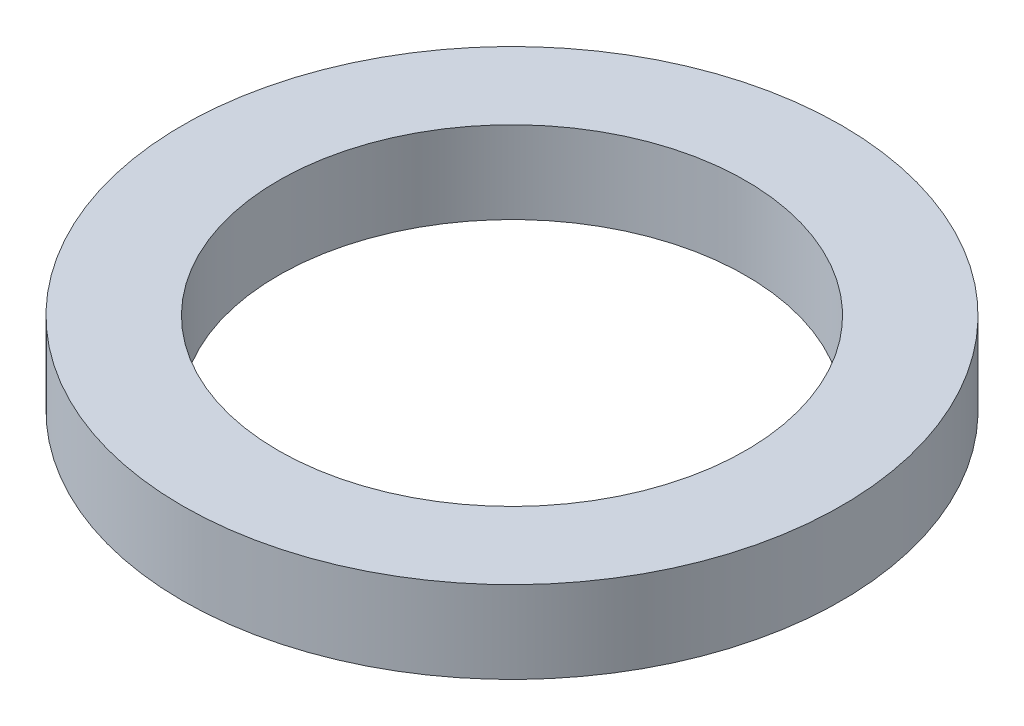
ISO-10303-21;
HEADER;
FILE_DESCRIPTION(('STEP AP214'),'2;1');
FILE_NAME('part.step','',(''),(''),'','','');
FILE_SCHEMA(('AUTOMOTIVE_DESIGN { 1 0 10303 214 1 1 1 1 }'));
ENDSEC;
DATA;
#1=APPLICATION_CONTEXT('core data for automotive mechanical design processes');
#2=APPLICATION_PROTOCOL_DEFINITION('international standard','automotive_design',2000,#1);
#3=PRODUCT_CONTEXT('',#1,'mechanical');
#4=PRODUCT('Part','Part','',(#3));
#5=PRODUCT_RELATED_PRODUCT_CATEGORY('part','',(#4));
#6=PRODUCT_DEFINITION_FORMATION('','',#4);
#7=PRODUCT_DEFINITION_CONTEXT('part definition',#1,'design');
#8=PRODUCT_DEFINITION('design','',#6,#7);
#9=PRODUCT_DEFINITION_SHAPE('','',#8);
#10=(LENGTH_UNIT() NAMED_UNIT(*) SI_UNIT(.MILLI.,.METRE.));
#11=(NAMED_UNIT(*) PLANE_ANGLE_UNIT() SI_UNIT($,.RADIAN.));
#12=(NAMED_UNIT(*) SI_UNIT($,.STERADIAN.) SOLID_ANGLE_UNIT());
#13=UNCERTAINTY_MEASURE_WITH_UNIT(LENGTH_MEASURE(1.E-05),#10,'distance_accuracy_value','');
#14=(GEOMETRIC_REPRESENTATION_CONTEXT(3) GLOBAL_UNCERTAINTY_ASSIGNED_CONTEXT((#13)) GLOBAL_UNIT_ASSIGNED_CONTEXT((#10,
#11,#12)) REPRESENTATION_CONTEXT('',''));
#15=CARTESIAN_POINT('',(0.,0.,0.));
#16=DIRECTION('',(0.,0.,1.));
#17=DIRECTION('',(1.,0.,0.));
#18=AXIS2_PLACEMENT_3D('',#15,#16,#17);
#19=CARTESIAN_POINT('',(0.,22.7096404931965,0.));
#20=DIRECTION('',(0.,1.,0.));
#21=DIRECTION('',(0.,0.,1.));
#22=AXIS2_PLACEMENT_3D('',#19,#20,#21);
#23=CYLINDRICAL_SURFACE('',#22,27.1145);
#24=CARTESIAN_POINT('',(0.,-12.7,0.));
#25=DIRECTION('',(0.,1.,0.));
#26=DIRECTION('',(0.,0.,1.));
#27=AXIS2_PLACEMENT_3D('',#24,#25,#26);
#28=CIRCLE('',#27,27.1145);
#29=CARTESIAN_POINT('',(0.,-12.7,27.1145));
#30=VERTEX_POINT('',#29);
#31=EDGE_CURVE('E45',#30,#30,#28,.T.);
#32=ORIENTED_EDGE('',*,*,#31,.F.);
#33=EDGE_LOOP('',(#32));
#34=FACE_BOUND('',#33,.T.);
#35=CARTESIAN_POINT('',(0.,-3.175,0.));
#36=DIRECTION('',(0.,1.,0.));
#37=DIRECTION('',(0.,0.,1.));
#38=AXIS2_PLACEMENT_3D('',#35,#36,#37);
#39=CIRCLE('',#38,27.1145);
#40=CARTESIAN_POINT('',(0.,-3.175,27.1145));
#41=VERTEX_POINT('',#40);
#42=EDGE_CURVE('E10',#41,#41,#39,.T.);
#43=ORIENTED_EDGE('',*,*,#42,.T.);
#44=EDGE_LOOP('',(#43));
#45=FACE_BOUND('',#44,.T.);
#46=ADVANCED_FACE('F31',(#34,#45),#23,.F.);
#47=CARTESIAN_POINT('',(27.1145,-3.175,0.));
#48=DIRECTION('',(0.,-1.,0.));
#49=DIRECTION('',(0.,0.,-1.));
#50=AXIS2_PLACEMENT_3D('',#47,#48,#49);
#51=PLANE('',#50);
#52=ORIENTED_EDGE('',*,*,#42,.F.);
#53=EDGE_LOOP('',(#52));
#54=FACE_BOUND('',#53,.T.);
#55=CARTESIAN_POINT('',(0.,-3.175,0.));
#56=DIRECTION('',(0.,1.,0.));
#57=DIRECTION('',(0.,0.,1.));
#58=AXIS2_PLACEMENT_3D('',#55,#56,#57);
#59=CIRCLE('',#58,38.227);
#60=CARTESIAN_POINT('',(0.,-3.175,38.227));
#61=VERTEX_POINT('',#60);
#62=EDGE_CURVE('E37',#61,#61,#59,.T.);
#63=ORIENTED_EDGE('',*,*,#62,.T.);
#64=EDGE_LOOP('',(#63));
#65=FACE_BOUND('',#64,.T.);
#66=ADVANCED_FACE('F54',(#54,#65),#51,.F.);
#67=CARTESIAN_POINT('',(0.,22.7096404931965,0.));
#68=DIRECTION('',(0.,1.,0.));
#69=DIRECTION('',(0.,0.,1.));
#70=AXIS2_PLACEMENT_3D('',#67,#68,#69);
#71=CYLINDRICAL_SURFACE('',#70,38.227);
#72=ORIENTED_EDGE('',*,*,#62,.F.);
#73=EDGE_LOOP('',(#72));
#74=FACE_BOUND('',#73,.T.);
#75=CARTESIAN_POINT('',(0.,-12.7,0.));
#76=DIRECTION('',(0.,1.,0.));
#77=DIRECTION('',(0.,0.,1.));
#78=AXIS2_PLACEMENT_3D('',#75,#76,#77);
#79=CIRCLE('',#78,38.227);
#80=CARTESIAN_POINT('',(0.,-12.7,38.227));
#81=VERTEX_POINT('',#80);
#82=EDGE_CURVE('E41',#81,#81,#79,.T.);
#83=ORIENTED_EDGE('',*,*,#82,.T.);
#84=EDGE_LOOP('',(#83));
#85=FACE_BOUND('',#84,.T.);
#86=ADVANCED_FACE('F58',(#74,#85),#71,.T.);
#87=CARTESIAN_POINT('',(27.1145,-12.7,0.));
#88=DIRECTION('',(0.,1.,0.));
#89=DIRECTION('',(0.,0.,1.));
#90=AXIS2_PLACEMENT_3D('',#87,#88,#89);
#91=PLANE('',#90);
#92=ORIENTED_EDGE('',*,*,#82,.F.);
#93=EDGE_LOOP('',(#92));
#94=FACE_BOUND('',#93,.T.);
#95=ORIENTED_EDGE('',*,*,#31,.T.);
#96=EDGE_LOOP('',(#95));
#97=FACE_BOUND('',#96,.T.);
#98=ADVANCED_FACE('F51',(#94,#97),#91,.F.);
#99=CLOSED_SHELL('',(#46,#66,#86,#98));
#100=MANIFOLD_SOLID_BREP('B2',#99);
#101=ADVANCED_BREP_SHAPE_REPRESENTATION('',(#18,#100),#14);
#102=SHAPE_DEFINITION_REPRESENTATION(#9,#101);
ENDSEC;
END-ISO-10303-21;
